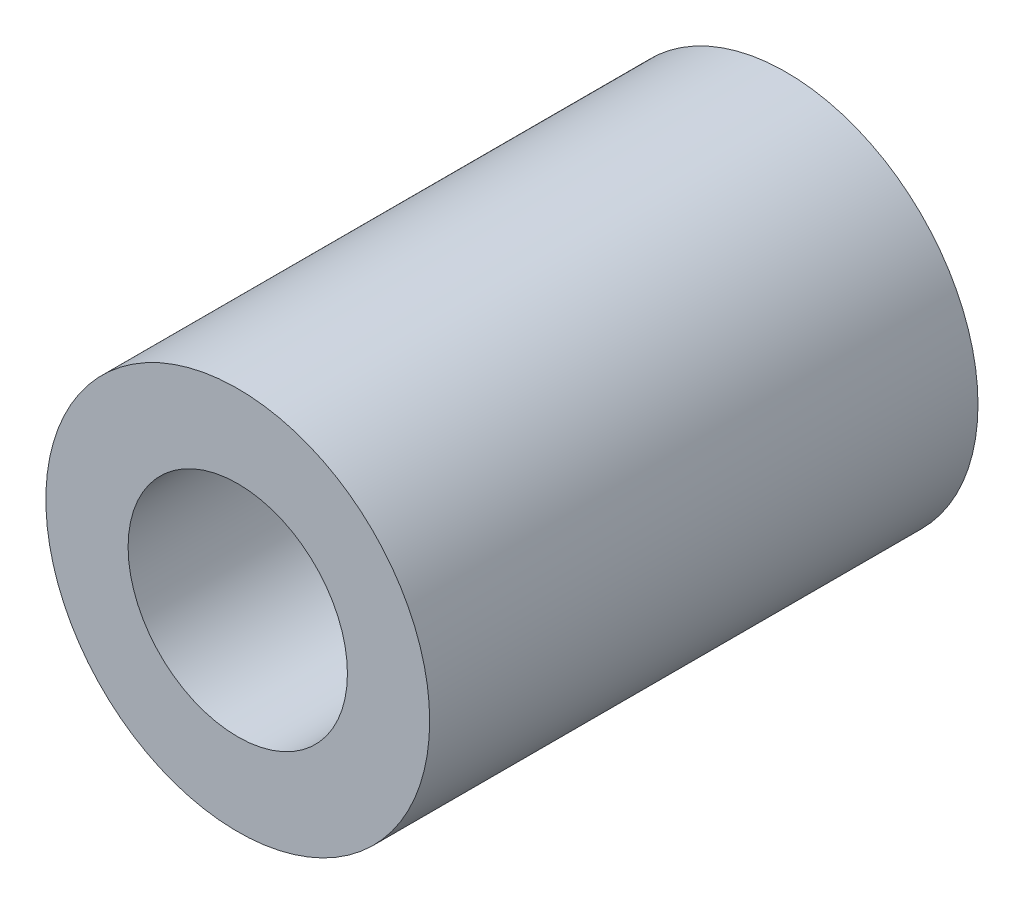
ISO-10303-21;
HEADER;
FILE_DESCRIPTION(('STEP AP214'),'2;1');
FILE_NAME('part.step','',(''),(''),'','','');
FILE_SCHEMA(('AUTOMOTIVE_DESIGN { 1 0 10303 214 1 1 1 1 }'));
ENDSEC;
DATA;
#1=APPLICATION_CONTEXT('core data for automotive mechanical design processes');
#2=APPLICATION_PROTOCOL_DEFINITION('international standard','automotive_design',2000,#1);
#3=PRODUCT_CONTEXT('',#1,'mechanical');
#4=PRODUCT('Part','Part','',(#3));
#5=PRODUCT_RELATED_PRODUCT_CATEGORY('part','',(#4));
#6=PRODUCT_DEFINITION_FORMATION('','',#4);
#7=PRODUCT_DEFINITION_CONTEXT('part definition',#1,'design');
#8=PRODUCT_DEFINITION('design','',#6,#7);
#9=PRODUCT_DEFINITION_SHAPE('','',#8);
#10=(LENGTH_UNIT() NAMED_UNIT(*) SI_UNIT(.MILLI.,.METRE.));
#11=(NAMED_UNIT(*) PLANE_ANGLE_UNIT() SI_UNIT($,.RADIAN.));
#12=(NAMED_UNIT(*) SI_UNIT($,.STERADIAN.) SOLID_ANGLE_UNIT());
#13=UNCERTAINTY_MEASURE_WITH_UNIT(LENGTH_MEASURE(1.E-05),#10,'distance_accuracy_value','');
#14=(GEOMETRIC_REPRESENTATION_CONTEXT(3) GLOBAL_UNCERTAINTY_ASSIGNED_CONTEXT((#13)) GLOBAL_UNIT_ASSIGNED_CONTEXT((#10,
#11,#12)) REPRESENTATION_CONTEXT('',''));
#15=CARTESIAN_POINT('',(0.,0.,0.));
#16=DIRECTION('',(0.,0.,1.));
#17=DIRECTION('',(1.,0.,0.));
#18=AXIS2_PLACEMENT_3D('',#15,#16,#17);
#19=CARTESIAN_POINT('',(0.,0.,0.));
#20=DIRECTION('',(0.,0.,1.));
#21=DIRECTION('',(1.,0.,0.));
#22=AXIS2_PLACEMENT_3D('',#19,#20,#21);
#23=PLANE('',#22);
#24=CARTESIAN_POINT('',(0.,0.,0.));
#25=DIRECTION('',(0.,0.,1.));
#26=DIRECTION('',(1.,0.,0.));
#27=AXIS2_PLACEMENT_3D('',#24,#25,#26);
#28=CIRCLE('',#27,7.);
#29=CARTESIAN_POINT('',(7.,0.,0.));
#30=VERTEX_POINT('',#29);
#31=EDGE_CURVE('E10',#30,#30,#28,.T.);
#32=ORIENTED_EDGE('',*,*,#31,.F.);
#33=EDGE_LOOP('',(#32));
#34=FACE_BOUND('',#33,.T.);
#35=CARTESIAN_POINT('',(0.,0.,0.));
#36=DIRECTION('',(0.,0.,1.));
#37=DIRECTION('',(1.,0.,0.));
#38=AXIS2_PLACEMENT_3D('',#35,#36,#37);
#39=CIRCLE('',#38,3.);
#40=CARTESIAN_POINT('',(3.,0.,0.));
#41=VERTEX_POINT('',#40);
#42=EDGE_CURVE('E40',#41,#41,#39,.T.);
#43=ORIENTED_EDGE('',*,*,#42,.T.);
#44=EDGE_LOOP('',(#43));
#45=FACE_BOUND('',#44,.T.);
#46=ADVANCED_FACE('F33',(#34,#45),#23,.F.);
#47=CARTESIAN_POINT('',(0.,0.,10.));
#48=DIRECTION('',(0.,0.,-1.));
#49=DIRECTION('',(-1.,0.,0.));
#50=AXIS2_PLACEMENT_3D('',#47,#48,#49);
#51=CYLINDRICAL_SURFACE('',#50,7.);
#52=ORIENTED_EDGE('',*,*,#31,.T.);
#53=EDGE_LOOP('',(#52));
#54=FACE_BOUND('',#53,.T.);
#55=CARTESIAN_POINT('',(0.,0.,20.));
#56=DIRECTION('',(0.,0.,1.));
#57=DIRECTION('',(1.,0.,0.));
#58=AXIS2_PLACEMENT_3D('',#55,#56,#57);
#59=CIRCLE('',#58,7.);
#60=CARTESIAN_POINT('',(7.,0.,20.));
#61=VERTEX_POINT('',#60);
#62=EDGE_CURVE('E48',#61,#61,#59,.T.);
#63=ORIENTED_EDGE('',*,*,#62,.F.);
#64=EDGE_LOOP('',(#63));
#65=FACE_BOUND('',#64,.T.);
#66=ADVANCED_FACE('F35',(#54,#65),#51,.T.);
#67=CARTESIAN_POINT('',(0.,0.,10.));
#68=DIRECTION('',(0.,0.,-1.));
#69=DIRECTION('',(-1.,0.,0.));
#70=AXIS2_PLACEMENT_3D('',#67,#68,#69);
#71=CYLINDRICAL_SURFACE('',#70,3.);
#72=CARTESIAN_POINT('',(0.,0.,10.));
#73=DIRECTION('',(0.,0.,1.));
#74=DIRECTION('',(1.,0.,0.));
#75=AXIS2_PLACEMENT_3D('',#72,#73,#74);
#76=CIRCLE('',#75,3.);
#77=CARTESIAN_POINT('',(3.,0.,10.));
#78=VERTEX_POINT('',#77);
#79=EDGE_CURVE('E44',#78,#78,#76,.T.);
#80=ORIENTED_EDGE('',*,*,#79,.T.);
#81=EDGE_LOOP('',(#80));
#82=FACE_BOUND('',#81,.T.);
#83=ORIENTED_EDGE('',*,*,#42,.F.);
#84=EDGE_LOOP('',(#83));
#85=FACE_BOUND('',#84,.T.);
#86=ADVANCED_FACE('F76',(#82,#85),#71,.F.);
#87=CARTESIAN_POINT('',(0.,0.,10.));
#88=DIRECTION('',(0.,0.,1.));
#89=DIRECTION('',(1.,0.,0.));
#90=AXIS2_PLACEMENT_3D('',#87,#88,#89);
#91=PLANE('',#90);
#92=ORIENTED_EDGE('',*,*,#79,.F.);
#93=EDGE_LOOP('',(#92));
#94=FACE_BOUND('',#93,.T.);
#95=ADVANCED_FACE('F71',(#94),#91,.F.);
#96=CARTESIAN_POINT('',(0.,0.,20.));
#97=DIRECTION('',(0.,0.,1.));
#98=DIRECTION('',(1.,0.,0.));
#99=AXIS2_PLACEMENT_3D('',#96,#97,#98);
#100=PLANE('',#99);
#101=CARTESIAN_POINT('',(0.,0.,20.));
#102=DIRECTION('',(0.,0.,1.));
#103=DIRECTION('',(1.,0.,0.));
#104=AXIS2_PLACEMENT_3D('',#101,#102,#103);
#105=CIRCLE('',#104,4.);
#106=CARTESIAN_POINT('',(4.,0.,20.));
#107=VERTEX_POINT('',#106);
#108=EDGE_CURVE('E54',#107,#107,#105,.T.);
#109=ORIENTED_EDGE('',*,*,#108,.F.);
#110=EDGE_LOOP('',(#109));
#111=FACE_BOUND('',#110,.T.);
#112=ORIENTED_EDGE('',*,*,#62,.T.);
#113=EDGE_LOOP('',(#112));
#114=FACE_BOUND('',#113,.T.);
#115=ADVANCED_FACE('F65',(#111,#114),#100,.T.);
#116=CARTESIAN_POINT('',(0.,0.,12.));
#117=DIRECTION('',(0.,0.,1.));
#118=DIRECTION('',(1.,0.,0.));
#119=AXIS2_PLACEMENT_3D('',#116,#117,#118);
#120=CYLINDRICAL_SURFACE('',#119,4.);
#121=CARTESIAN_POINT('',(0.,0.,12.));
#122=DIRECTION('',(0.,0.,1.));
#123=DIRECTION('',(1.,0.,0.));
#124=AXIS2_PLACEMENT_3D('',#121,#122,#123);
#125=CIRCLE('',#124,4.);
#126=CARTESIAN_POINT('',(4.,0.,12.));
#127=VERTEX_POINT('',#126);
#128=EDGE_CURVE('E53',#127,#127,#125,.T.);
#129=ORIENTED_EDGE('',*,*,#128,.F.);
#130=EDGE_LOOP('',(#129));
#131=FACE_BOUND('',#130,.T.);
#132=ORIENTED_EDGE('',*,*,#108,.T.);
#133=EDGE_LOOP('',(#132));
#134=FACE_BOUND('',#133,.T.);
#135=ADVANCED_FACE('F62',(#131,#134),#120,.F.);
#136=CARTESIAN_POINT('',(0.,0.,12.));
#137=DIRECTION('',(0.,0.,1.));
#138=DIRECTION('',(1.,0.,0.));
#139=AXIS2_PLACEMENT_3D('',#136,#137,#138);
#140=PLANE('',#139);
#141=ORIENTED_EDGE('',*,*,#128,.T.);
#142=EDGE_LOOP('',(#141));
#143=FACE_BOUND('',#142,.T.);
#144=ADVANCED_FACE('F60',(#143),#140,.T.);
#145=CLOSED_SHELL('',(#46,#66,#86,#95,#115,#135,#144));
#146=MANIFOLD_SOLID_BREP('B2',#145);
#147=ADVANCED_BREP_SHAPE_REPRESENTATION('',(#18,#146),#14);
#148=SHAPE_DEFINITION_REPRESENTATION(#9,#147);
ENDSEC;
END-ISO-10303-21;
